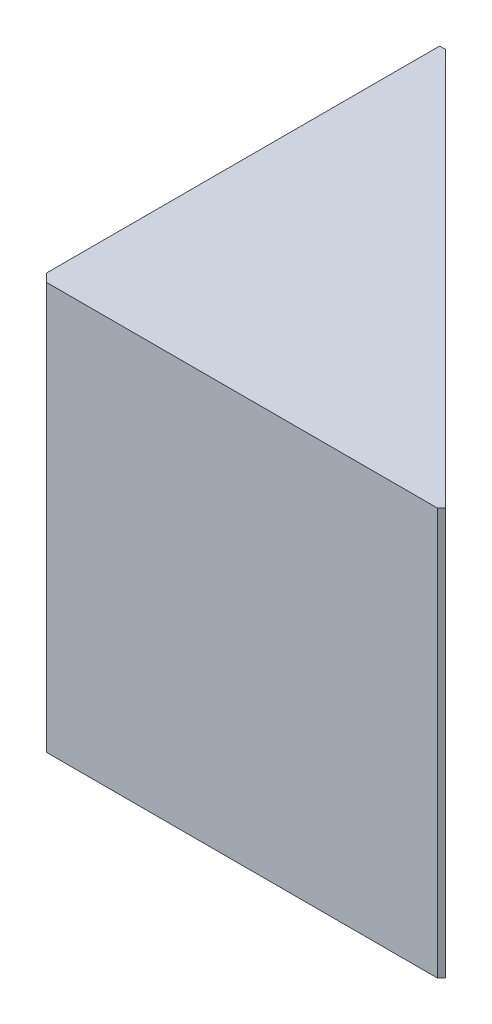
ISO-10303-21;
HEADER;
FILE_DESCRIPTION(('STEP AP214'),'2;1');
FILE_NAME('part.step','',(''),(''),'','','');
FILE_SCHEMA(('AUTOMOTIVE_DESIGN { 1 0 10303 214 1 1 1 1 }'));
ENDSEC;
DATA;
#1=APPLICATION_CONTEXT('core data for automotive mechanical design processes');
#2=APPLICATION_PROTOCOL_DEFINITION('international standard','automotive_design',2000,#1);
#3=PRODUCT_CONTEXT('',#1,'mechanical');
#4=PRODUCT('Part','Part','',(#3));
#5=PRODUCT_RELATED_PRODUCT_CATEGORY('part','',(#4));
#6=PRODUCT_DEFINITION_FORMATION('','',#4);
#7=PRODUCT_DEFINITION_CONTEXT('part definition',#1,'design');
#8=PRODUCT_DEFINITION('design','',#6,#7);
#9=PRODUCT_DEFINITION_SHAPE('','',#8);
#10=(LENGTH_UNIT() NAMED_UNIT(*) SI_UNIT(.MILLI.,.METRE.));
#11=(NAMED_UNIT(*) PLANE_ANGLE_UNIT() SI_UNIT($,.RADIAN.));
#12=(NAMED_UNIT(*) SI_UNIT($,.STERADIAN.) SOLID_ANGLE_UNIT());
#13=UNCERTAINTY_MEASURE_WITH_UNIT(LENGTH_MEASURE(1.E-05),#10,'distance_accuracy_value','');
#14=(GEOMETRIC_REPRESENTATION_CONTEXT(3) GLOBAL_UNCERTAINTY_ASSIGNED_CONTEXT((#13)) GLOBAL_UNIT_ASSIGNED_CONTEXT((#10,
#11,#12)) REPRESENTATION_CONTEXT('',''));
#15=CARTESIAN_POINT('',(0.,0.,0.));
#16=DIRECTION('',(0.,0.,1.));
#17=DIRECTION('',(1.,0.,0.));
#18=AXIS2_PLACEMENT_3D('',#15,#16,#17);
#19=CARTESIAN_POINT('',(-2.5,5.,-2.5));
#20=DIRECTION('',(1.,0.,0.));
#21=DIRECTION('',(0.,0.,-1.));
#22=AXIS2_PLACEMENT_3D('',#19,#20,#21);
#23=PLANE('',#22);
#24=DIRECTION('',(0.,0.,1.));
#25=VECTOR('',#24,1.);
#26=CARTESIAN_POINT('',(-2.5,5.,-2.5));
#27=LINE('',#26,#25);
#28=CARTESIAN_POINT('',(-2.5,5.,-2.42928932188134));
#29=VERTEX_POINT('',#28);
#30=CARTESIAN_POINT('',(-2.5,5.,2.4));
#31=VERTEX_POINT('',#30);
#32=EDGE_CURVE('E105',#29,#31,#27,.T.);
#33=ORIENTED_EDGE('',*,*,#32,.F.);
#34=DIRECTION('',(0.,-1.,0.));
#35=VECTOR('',#34,1.);
#36=CARTESIAN_POINT('',(-2.5,5.,-2.42928932188134));
#37=LINE('',#36,#35);
#38=CARTESIAN_POINT('',(-2.5,0.,-2.42928932188134));
#39=VERTEX_POINT('',#38);
#40=EDGE_CURVE('E91',#29,#39,#37,.T.);
#41=ORIENTED_EDGE('',*,*,#40,.T.);
#42=DIRECTION('',(0.,0.,1.));
#43=VECTOR('',#42,1.);
#44=CARTESIAN_POINT('',(-2.5,0.,-2.5));
#45=LINE('',#44,#43);
#46=CARTESIAN_POINT('',(-2.5,0.,2.4));
#47=VERTEX_POINT('',#46);
#48=EDGE_CURVE('E103',#39,#47,#45,.T.);
#49=ORIENTED_EDGE('',*,*,#48,.T.);
#50=DIRECTION('',(0.,1.,0.));
#51=VECTOR('',#50,1.);
#52=CARTESIAN_POINT('',(-2.5,5.,2.4));
#53=LINE('',#52,#51);
#54=EDGE_CURVE('E107',#47,#31,#53,.T.);
#55=ORIENTED_EDGE('',*,*,#54,.T.);
#56=EDGE_LOOP('',(#33,#41,#49,#55));
#57=FACE_BOUND('',#56,.T.);
#58=ADVANCED_FACE('F34',(#57),#23,.F.);
#59=CARTESIAN_POINT('',(-2.5,5.,2.5));
#60=DIRECTION('',(0.,0.,-1.));
#61=DIRECTION('',(-1.,0.,0.));
#62=AXIS2_PLACEMENT_3D('',#59,#60,#61);
#63=PLANE('',#62);
#64=DIRECTION('',(1.,0.,0.));
#65=VECTOR('',#64,1.);
#66=CARTESIAN_POINT('',(-2.5,0.,2.5));
#67=LINE('',#66,#65);
#68=CARTESIAN_POINT('',(-2.4,0.,2.5));
#69=VERTEX_POINT('',#68);
#70=CARTESIAN_POINT('',(2.4,0.,2.5));
#71=VERTEX_POINT('',#70);
#72=EDGE_CURVE('E111',#69,#71,#67,.T.);
#73=ORIENTED_EDGE('',*,*,#72,.T.);
#74=DIRECTION('',(0.,1.,0.));
#75=VECTOR('',#74,1.);
#76=CARTESIAN_POINT('',(2.4,5.,2.5));
#77=LINE('',#76,#75);
#78=CARTESIAN_POINT('',(2.4,5.,2.5));
#79=VERTEX_POINT('',#78);
#80=EDGE_CURVE('E11',#71,#79,#77,.T.);
#81=ORIENTED_EDGE('',*,*,#80,.T.);
#82=DIRECTION('',(1.,0.,0.));
#83=VECTOR('',#82,1.);
#84=CARTESIAN_POINT('',(-2.5,5.,2.5));
#85=LINE('',#84,#83);
#86=CARTESIAN_POINT('',(-2.4,5.,2.5));
#87=VERTEX_POINT('',#86);
#88=EDGE_CURVE('E118',#87,#79,#85,.T.);
#89=ORIENTED_EDGE('',*,*,#88,.F.);
#90=DIRECTION('',(0.,-1.,0.));
#91=VECTOR('',#90,1.);
#92=CARTESIAN_POINT('',(-2.4,5.,2.5));
#93=LINE('',#92,#91);
#94=EDGE_CURVE('E42',#87,#69,#93,.T.);
#95=ORIENTED_EDGE('',*,*,#94,.T.);
#96=EDGE_LOOP('',(#73,#81,#89,#95));
#97=FACE_BOUND('',#96,.T.);
#98=ADVANCED_FACE('F133',(#97),#63,.F.);
#99=CARTESIAN_POINT('',(0.,5.,0.));
#100=DIRECTION('',(0.,1.,0.));
#101=DIRECTION('',(0.,0.,1.));
#102=AXIS2_PLACEMENT_3D('',#99,#100,#101);
#103=PLANE('',#102);
#104=DIRECTION('',(0.707106781186548,0.,0.707106781186547));
#105=VECTOR('',#104,1.);
#106=CARTESIAN_POINT('',(-2.5,5.,-2.5));
#107=LINE('',#106,#105);
#108=CARTESIAN_POINT('',(-2.42928932188134,5.,-2.42928932188135));
#109=VERTEX_POINT('',#108);
#110=CARTESIAN_POINT('',(2.45,5.,2.45));
#111=VERTEX_POINT('',#110);
#112=EDGE_CURVE('E115',#109,#111,#107,.T.);
#113=ORIENTED_EDGE('',*,*,#112,.F.);
#114=DIRECTION('',(1.,0.,0.));
#115=VECTOR('',#114,1.);
#116=CARTESIAN_POINT('',(0.,5.,-2.42928932188136));
#117=LINE('',#116,#115);
#118=EDGE_CURVE('E130',#109,#29,#117,.F.);
#119=ORIENTED_EDGE('',*,*,#118,.T.);
#120=ORIENTED_EDGE('',*,*,#32,.T.);
#121=DIRECTION('',(-0.707106781186548,0.,-0.707106781186548));
#122=VECTOR('',#121,1.);
#123=CARTESIAN_POINT('',(-2.45,5.,2.45));
#124=LINE('',#123,#122);
#125=EDGE_CURVE('E54',#31,#87,#124,.F.);
#126=ORIENTED_EDGE('',*,*,#125,.T.);
#127=ORIENTED_EDGE('',*,*,#88,.T.);
#128=DIRECTION('',(-0.707106781186535,0.,0.70710678118656));
#129=VECTOR('',#128,1.);
#130=CARTESIAN_POINT('',(2.45000000000004,5.,2.44999999999995));
#131=LINE('',#130,#129);
#132=EDGE_CURVE('E128',#79,#111,#131,.F.);
#133=ORIENTED_EDGE('',*,*,#132,.T.);
#134=EDGE_LOOP('',(#113,#119,#120,#126,#127,#133));
#135=FACE_BOUND('',#134,.T.);
#136=ADVANCED_FACE('F144',(#135),#103,.T.);
#137=CARTESIAN_POINT('',(0.,0.,0.));
#138=DIRECTION('',(0.,1.,0.));
#139=DIRECTION('',(0.,0.,1.));
#140=AXIS2_PLACEMENT_3D('',#137,#138,#139);
#141=PLANE('',#140);
#142=ORIENTED_EDGE('',*,*,#48,.F.);
#143=DIRECTION('',(-1.,0.,0.));
#144=VECTOR('',#143,1.);
#145=CARTESIAN_POINT('',(-2.5,0.,-2.42928932188134));
#146=LINE('',#145,#144);
#147=CARTESIAN_POINT('',(-2.42928932188134,0.,-2.42928932188135));
#148=VERTEX_POINT('',#147);
#149=EDGE_CURVE('E87',#39,#148,#146,.F.);
#150=ORIENTED_EDGE('',*,*,#149,.T.);
#151=DIRECTION('',(0.707106781186548,0.,0.707106781186547));
#152=VECTOR('',#151,1.);
#153=CARTESIAN_POINT('',(-2.5,0.,-2.5));
#154=LINE('',#153,#152);
#155=CARTESIAN_POINT('',(2.45,0.,2.45));
#156=VERTEX_POINT('',#155);
#157=EDGE_CURVE('E112',#148,#156,#154,.T.);
#158=ORIENTED_EDGE('',*,*,#157,.T.);
#159=DIRECTION('',(0.707106781186535,0.,-0.70710678118656));
#160=VECTOR('',#159,1.);
#161=CARTESIAN_POINT('',(2.45,0.,2.45));
#162=LINE('',#161,#160);
#163=EDGE_CURVE('E98',#156,#71,#162,.F.);
#164=ORIENTED_EDGE('',*,*,#163,.T.);
#165=ORIENTED_EDGE('',*,*,#72,.F.);
#166=DIRECTION('',(0.707106781186548,0.,0.707106781186548));
#167=VECTOR('',#166,1.);
#168=CARTESIAN_POINT('',(-2.4,0.,2.5));
#169=LINE('',#168,#167);
#170=EDGE_CURVE('E106',#69,#47,#169,.F.);
#171=ORIENTED_EDGE('',*,*,#170,.T.);
#172=EDGE_LOOP('',(#142,#150,#158,#164,#165,#171));
#173=FACE_BOUND('',#172,.T.);
#174=ADVANCED_FACE('F109',(#173),#141,.F.);
#175=CARTESIAN_POINT('',(-2.5,0.,-2.5));
#176=DIRECTION('',(-0.707106781186547,0.,0.707106781186548));
#177=DIRECTION('',(0.707106781186548,0.,0.707106781186547));
#178=AXIS2_PLACEMENT_3D('',#175,#176,#177);
#179=PLANE('',#178);
#180=ORIENTED_EDGE('',*,*,#157,.F.);
#181=DIRECTION('',(0.,1.,0.));
#182=VECTOR('',#181,1.);
#183=CARTESIAN_POINT('',(-2.42928932188134,0.,-2.42928932188135));
#184=LINE('',#183,#182);
#185=EDGE_CURVE('E92',#148,#109,#184,.T.);
#186=ORIENTED_EDGE('',*,*,#185,.T.);
#187=ORIENTED_EDGE('',*,*,#112,.T.);
#188=DIRECTION('',(0.,-1.,0.));
#189=VECTOR('',#188,1.);
#190=CARTESIAN_POINT('',(2.45,0.,2.45));
#191=LINE('',#190,#189);
#192=EDGE_CURVE('E97',#111,#156,#191,.T.);
#193=ORIENTED_EDGE('',*,*,#192,.T.);
#194=EDGE_LOOP('',(#180,#186,#187,#193));
#195=FACE_BOUND('',#194,.T.);
#196=ADVANCED_FACE('F141',(#195),#179,.F.);
#197=CARTESIAN_POINT('',(-2.5,5.,-2.42928932188134));
#198=DIRECTION('',(0.,0.,1.));
#199=DIRECTION('',(0.,-1.,0.));
#200=AXIS2_PLACEMENT_3D('',#197,#198,#199);
#201=PLANE('',#200);
#202=ORIENTED_EDGE('',*,*,#118,.F.);
#203=ORIENTED_EDGE('',*,*,#185,.F.);
#204=ORIENTED_EDGE('',*,*,#149,.F.);
#205=ORIENTED_EDGE('',*,*,#40,.F.);
#206=EDGE_LOOP('',(#202,#203,#204,#205));
#207=FACE_BOUND('',#206,.T.);
#208=ADVANCED_FACE('F90',(#207),#201,.F.);
#209=CARTESIAN_POINT('',(2.45,0.,2.45));
#210=DIRECTION('',(-0.70710678118656,0.,-0.707106781186535));
#211=DIRECTION('',(0.,-1.,0.));
#212=AXIS2_PLACEMENT_3D('',#209,#210,#211);
#213=PLANE('',#212);
#214=ORIENTED_EDGE('',*,*,#132,.F.);
#215=ORIENTED_EDGE('',*,*,#80,.F.);
#216=ORIENTED_EDGE('',*,*,#163,.F.);
#217=ORIENTED_EDGE('',*,*,#192,.F.);
#218=EDGE_LOOP('',(#214,#215,#216,#217));
#219=FACE_BOUND('',#218,.T.);
#220=ADVANCED_FACE('F138',(#219),#213,.F.);
#221=CARTESIAN_POINT('',(-2.4,5.,2.5));
#222=DIRECTION('',(0.707106781186548,0.,-0.707106781186548));
#223=DIRECTION('',(0.,-1.,0.));
#224=AXIS2_PLACEMENT_3D('',#221,#222,#223);
#225=PLANE('',#224);
#226=ORIENTED_EDGE('',*,*,#125,.F.);
#227=ORIENTED_EDGE('',*,*,#54,.F.);
#228=ORIENTED_EDGE('',*,*,#170,.F.);
#229=ORIENTED_EDGE('',*,*,#94,.F.);
#230=EDGE_LOOP('',(#226,#227,#228,#229));
#231=FACE_BOUND('',#230,.T.);
#232=ADVANCED_FACE('F36',(#231),#225,.F.);
#233=CLOSED_SHELL('',(#58,#98,#136,#174,#196,#208,#220,#232));
#234=MANIFOLD_SOLID_BREP('B2',#233);
#235=ADVANCED_BREP_SHAPE_REPRESENTATION('',(#18,#234),#14);
#236=SHAPE_DEFINITION_REPRESENTATION(#9,#235);
ENDSEC;
END-ISO-10303-21;
